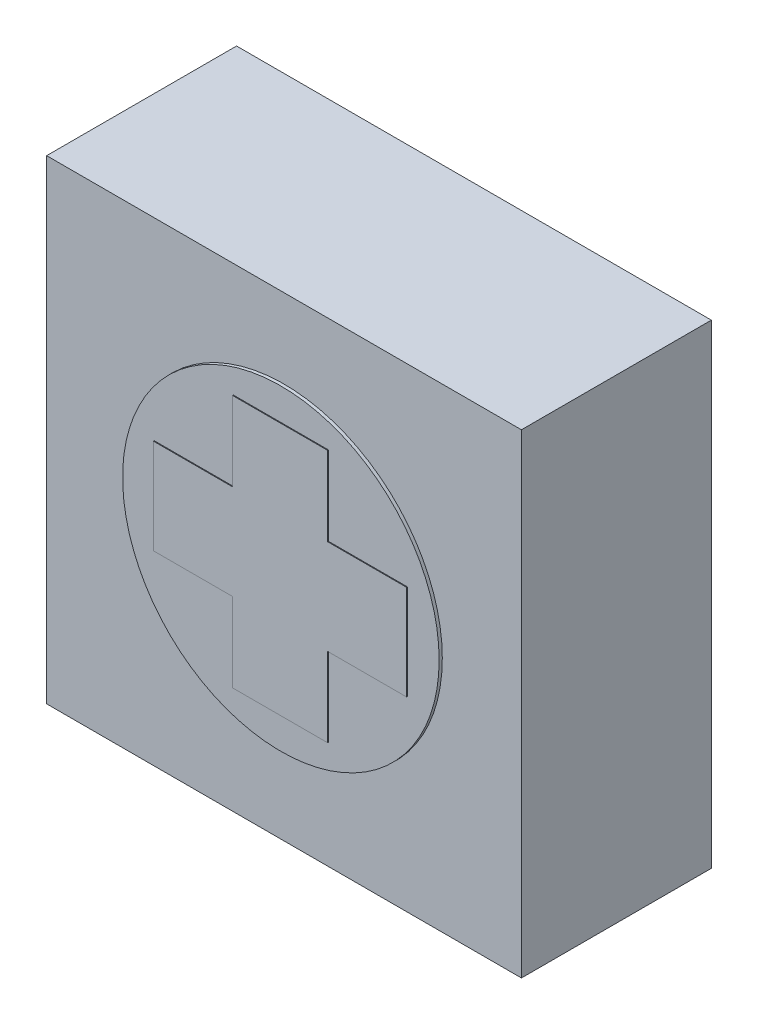
ISO-10303-21;
HEADER;
FILE_DESCRIPTION(('STEP AP214'),'2;1');
FILE_NAME('part.step','',(''),(''),'','','');
FILE_SCHEMA(('AUTOMOTIVE_DESIGN { 1 0 10303 214 1 1 1 1 }'));
ENDSEC;
DATA;
#1=APPLICATION_CONTEXT('core data for automotive mechanical design processes');
#2=APPLICATION_PROTOCOL_DEFINITION('international standard','automotive_design',2000,#1);
#3=PRODUCT_CONTEXT('',#1,'mechanical');
#4=PRODUCT('Part','Part','',(#3));
#5=PRODUCT_RELATED_PRODUCT_CATEGORY('part','',(#4));
#6=PRODUCT_DEFINITION_FORMATION('','',#4);
#7=PRODUCT_DEFINITION_CONTEXT('part definition',#1,'design');
#8=PRODUCT_DEFINITION('design','',#6,#7);
#9=PRODUCT_DEFINITION_SHAPE('','',#8);
#10=(LENGTH_UNIT() NAMED_UNIT(*) SI_UNIT(.MILLI.,.METRE.));
#11=(NAMED_UNIT(*) PLANE_ANGLE_UNIT() SI_UNIT($,.RADIAN.));
#12=(NAMED_UNIT(*) SI_UNIT($,.STERADIAN.) SOLID_ANGLE_UNIT());
#13=UNCERTAINTY_MEASURE_WITH_UNIT(LENGTH_MEASURE(1.E-05),#10,'distance_accuracy_value','');
#14=(GEOMETRIC_REPRESENTATION_CONTEXT(3) GLOBAL_UNCERTAINTY_ASSIGNED_CONTEXT((#13)) GLOBAL_UNIT_ASSIGNED_CONTEXT((#10,
#11,#12)) REPRESENTATION_CONTEXT('',''));
#15=CARTESIAN_POINT('',(0.,0.,0.));
#16=DIRECTION('',(0.,0.,1.));
#17=DIRECTION('',(1.,0.,0.));
#18=AXIS2_PLACEMENT_3D('',#15,#16,#17);
#19=CARTESIAN_POINT('',(37.5,37.5,15.0993109944239));
#20=DIRECTION('',(-1.,0.,0.));
#21=DIRECTION('',(0.,0.,1.));
#22=AXIS2_PLACEMENT_3D('',#19,#20,#21);
#23=PLANE('',#22);
#24=DIRECTION('',(0.,1.,0.));
#25=VECTOR('',#24,1.);
#26=CARTESIAN_POINT('',(37.5,37.5,-14.9006890055761));
#27=LINE('',#26,#25);
#28=CARTESIAN_POINT('',(37.5,-37.5,-14.9006890055761));
#29=VERTEX_POINT('',#28);
#30=CARTESIAN_POINT('',(37.5,37.5,-14.9006890055761));
#31=VERTEX_POINT('',#30);
#32=EDGE_CURVE('E243',#29,#31,#27,.T.);
#33=ORIENTED_EDGE('',*,*,#32,.T.);
#34=DIRECTION('',(0.,0.,-1.));
#35=VECTOR('',#34,1.);
#36=CARTESIAN_POINT('',(37.5,37.5,15.0993109944239));
#37=LINE('',#36,#35);
#38=CARTESIAN_POINT('',(37.5,37.5,15.0993109944239));
#39=VERTEX_POINT('',#38);
#40=EDGE_CURVE('E248',#39,#31,#37,.T.);
#41=ORIENTED_EDGE('',*,*,#40,.F.);
#42=DIRECTION('',(0.,1.,0.));
#43=VECTOR('',#42,1.);
#44=CARTESIAN_POINT('',(37.5,37.5,15.0993109944239));
#45=LINE('',#44,#43);
#46=CARTESIAN_POINT('',(37.5,-37.5,15.0993109944239));
#47=VERTEX_POINT('',#46);
#48=EDGE_CURVE('E249',#47,#39,#45,.T.);
#49=ORIENTED_EDGE('',*,*,#48,.F.);
#50=DIRECTION('',(0.,0.,-1.));
#51=VECTOR('',#50,1.);
#52=CARTESIAN_POINT('',(37.5,-37.5,15.0993109944239));
#53=LINE('',#52,#51);
#54=EDGE_CURVE('E255',#47,#29,#53,.T.);
#55=ORIENTED_EDGE('',*,*,#54,.T.);
#56=EDGE_LOOP('',(#33,#41,#49,#55));
#57=FACE_BOUND('',#56,.T.);
#58=ADVANCED_FACE('F44',(#57),#23,.F.);
#59=CARTESIAN_POINT('',(-37.5,37.5,15.0993109944239));
#60=DIRECTION('',(0.,-1.,0.));
#61=DIRECTION('',(0.,0.,-1.));
#62=AXIS2_PLACEMENT_3D('',#59,#60,#61);
#63=PLANE('',#62);
#64=DIRECTION('',(-1.,0.,0.));
#65=VECTOR('',#64,1.);
#66=CARTESIAN_POINT('',(-37.5,37.5,-14.9006890055761));
#67=LINE('',#66,#65);
#68=CARTESIAN_POINT('',(-37.5,37.5,-14.9006890055761));
#69=VERTEX_POINT('',#68);
#70=EDGE_CURVE('E258',#31,#69,#67,.T.);
#71=ORIENTED_EDGE('',*,*,#70,.T.);
#72=DIRECTION('',(0.,0.,-1.));
#73=VECTOR('',#72,1.);
#74=CARTESIAN_POINT('',(-37.5,37.5,15.0993109944239));
#75=LINE('',#74,#73);
#76=CARTESIAN_POINT('',(-37.5,37.5,15.0993109944239));
#77=VERTEX_POINT('',#76);
#78=EDGE_CURVE('E266',#77,#69,#75,.T.);
#79=ORIENTED_EDGE('',*,*,#78,.F.);
#80=DIRECTION('',(-1.,0.,0.));
#81=VECTOR('',#80,1.);
#82=CARTESIAN_POINT('',(-37.5,37.5,15.0993109944239));
#83=LINE('',#82,#81);
#84=EDGE_CURVE('E96',#39,#77,#83,.T.);
#85=ORIENTED_EDGE('',*,*,#84,.F.);
#86=ORIENTED_EDGE('',*,*,#40,.T.);
#87=EDGE_LOOP('',(#71,#79,#85,#86));
#88=FACE_BOUND('',#87,.T.);
#89=ADVANCED_FACE('F340',(#88),#63,.F.);
#90=CARTESIAN_POINT('',(-37.5,37.5,15.0993109944239));
#91=DIRECTION('',(1.,0.,0.));
#92=DIRECTION('',(0.,0.,-1.));
#93=AXIS2_PLACEMENT_3D('',#90,#91,#92);
#94=PLANE('',#93);
#95=DIRECTION('',(0.,-1.,0.));
#96=VECTOR('',#95,1.);
#97=CARTESIAN_POINT('',(-37.5,37.5,-14.9006890055761));
#98=LINE('',#97,#96);
#99=CARTESIAN_POINT('',(-37.5,-37.5,-14.9006890055761));
#100=VERTEX_POINT('',#99);
#101=EDGE_CURVE('E260',#69,#100,#98,.T.);
#102=ORIENTED_EDGE('',*,*,#101,.T.);
#103=DIRECTION('',(0.,0.,-1.));
#104=VECTOR('',#103,1.);
#105=CARTESIAN_POINT('',(-37.5,-37.5,15.0993109944239));
#106=LINE('',#105,#104);
#107=CARTESIAN_POINT('',(-37.5,-37.5,15.0993109944239));
#108=VERTEX_POINT('',#107);
#109=EDGE_CURVE('E264',#108,#100,#106,.T.);
#110=ORIENTED_EDGE('',*,*,#109,.F.);
#111=DIRECTION('',(0.,-1.,0.));
#112=VECTOR('',#111,1.);
#113=CARTESIAN_POINT('',(-37.5,37.5,15.0993109944239));
#114=LINE('',#113,#112);
#115=EDGE_CURVE('E252',#77,#108,#114,.T.);
#116=ORIENTED_EDGE('',*,*,#115,.F.);
#117=ORIENTED_EDGE('',*,*,#78,.T.);
#118=EDGE_LOOP('',(#102,#110,#116,#117));
#119=FACE_BOUND('',#118,.T.);
#120=ADVANCED_FACE('F345',(#119),#94,.F.);
#121=CARTESIAN_POINT('',(-37.5,-37.5,15.0993109944239));
#122=DIRECTION('',(0.,1.,0.));
#123=DIRECTION('',(0.,0.,1.));
#124=AXIS2_PLACEMENT_3D('',#121,#122,#123);
#125=PLANE('',#124);
#126=DIRECTION('',(1.,0.,0.));
#127=VECTOR('',#126,1.);
#128=CARTESIAN_POINT('',(-37.5,-37.5,-14.9006890055761));
#129=LINE('',#128,#127);
#130=EDGE_CURVE('E88',#100,#29,#129,.T.);
#131=ORIENTED_EDGE('',*,*,#130,.T.);
#132=ORIENTED_EDGE('',*,*,#54,.F.);
#133=DIRECTION('',(1.,0.,0.));
#134=VECTOR('',#133,1.);
#135=CARTESIAN_POINT('',(-37.5,-37.5,15.0993109944239));
#136=LINE('',#135,#134);
#137=EDGE_CURVE('E67',#108,#47,#136,.T.);
#138=ORIENTED_EDGE('',*,*,#137,.F.);
#139=ORIENTED_EDGE('',*,*,#109,.T.);
#140=EDGE_LOOP('',(#131,#132,#138,#139));
#141=FACE_BOUND('',#140,.T.);
#142=ADVANCED_FACE('F357',(#141),#125,.F.);
#143=CARTESIAN_POINT('',(0.,0.,15.0993109944239));
#144=DIRECTION('',(0.,0.,1.));
#145=DIRECTION('',(1.,0.,0.));
#146=AXIS2_PLACEMENT_3D('',#143,#144,#145);
#147=PLANE('',#146);
#148=CARTESIAN_POINT('',(0.,0.,15.0993109944239));
#149=DIRECTION('',(0.,0.,1.));
#150=DIRECTION('',(1.,0.,0.));
#151=AXIS2_PLACEMENT_3D('',#148,#149,#150);
#152=CIRCLE('',#151,25.);
#153=CARTESIAN_POINT('',(25.,0.,15.0993109944239));
#154=VERTEX_POINT('',#153);
#155=EDGE_CURVE('E244',#154,#154,#152,.T.);
#156=ORIENTED_EDGE('',*,*,#155,.F.);
#157=EDGE_LOOP('',(#156));
#158=FACE_BOUND('',#157,.T.);
#159=ORIENTED_EDGE('',*,*,#48,.T.);
#160=ORIENTED_EDGE('',*,*,#84,.T.);
#161=ORIENTED_EDGE('',*,*,#115,.T.);
#162=ORIENTED_EDGE('',*,*,#137,.T.);
#163=EDGE_LOOP('',(#159,#160,#161,#162));
#164=FACE_BOUND('',#163,.T.);
#165=ADVANCED_FACE('F355',(#158,#164),#147,.T.);
#166=CARTESIAN_POINT('',(0.,0.,-14.9006890055761));
#167=DIRECTION('',(0.,0.,1.));
#168=DIRECTION('',(1.,0.,0.));
#169=AXIS2_PLACEMENT_3D('',#166,#167,#168);
#170=PLANE('',#169);
#171=ORIENTED_EDGE('',*,*,#32,.F.);
#172=ORIENTED_EDGE('',*,*,#130,.F.);
#173=ORIENTED_EDGE('',*,*,#101,.F.);
#174=ORIENTED_EDGE('',*,*,#70,.F.);
#175=EDGE_LOOP('',(#171,#172,#173,#174));
#176=FACE_BOUND('',#175,.T.);
#177=ADVANCED_FACE('F350',(#176),#170,.F.);
#178=CARTESIAN_POINT('',(0.,0.,15.5993109944239));
#179=DIRECTION('',(0.,0.,-1.));
#180=DIRECTION('',(-1.,0.,0.));
#181=AXIS2_PLACEMENT_3D('',#178,#179,#180);
#182=CYLINDRICAL_SURFACE('',#181,25.);
#183=CARTESIAN_POINT('',(0.,0.,15.5993109944239));
#184=DIRECTION('',(0.,0.,1.));
#185=DIRECTION('',(1.,0.,0.));
#186=AXIS2_PLACEMENT_3D('',#183,#184,#185);
#187=CIRCLE('',#186,25.);
#188=CARTESIAN_POINT('',(25.,0.,15.5993109944239));
#189=VERTEX_POINT('',#188);
#190=EDGE_CURVE('E174',#189,#189,#187,.T.);
#191=ORIENTED_EDGE('',*,*,#190,.F.);
#192=EDGE_LOOP('',(#191));
#193=FACE_BOUND('',#192,.T.);
#194=ORIENTED_EDGE('',*,*,#155,.T.);
#195=EDGE_LOOP('',(#194));
#196=FACE_BOUND('',#195,.T.);
#197=ADVANCED_FACE('F364',(#193,#196),#182,.T.);
#198=CARTESIAN_POINT('',(0.,0.,15.5993109944239));
#199=DIRECTION('',(0.,0.,1.));
#200=DIRECTION('',(1.,0.,0.));
#201=AXIS2_PLACEMENT_3D('',#198,#199,#200);
#202=PLANE('',#201);
#203=DIRECTION('',(-1.,0.,0.));
#204=VECTOR('',#203,1.);
#205=CARTESIAN_POINT('',(0.,7.5,15.5993109944239));
#206=LINE('',#205,#204);
#207=CARTESIAN_POINT('',(-7.50000000000001,7.5,15.5993109944239));
#208=VERTEX_POINT('',#207);
#209=CARTESIAN_POINT('',(-20.,7.5,15.5993109944239));
#210=VERTEX_POINT('',#209);
#211=EDGE_CURVE('E11',#208,#210,#206,.T.);
#212=ORIENTED_EDGE('',*,*,#211,.F.);
#213=DIRECTION('',(0.,1.,0.));
#214=VECTOR('',#213,1.);
#215=CARTESIAN_POINT('',(-7.50000000000001,0.,15.5993109944239));
#216=LINE('',#215,#214);
#217=CARTESIAN_POINT('',(-7.50000000000001,20.,15.5993109944239));
#218=VERTEX_POINT('',#217);
#219=EDGE_CURVE('E247',#208,#218,#216,.T.);
#220=ORIENTED_EDGE('',*,*,#219,.T.);
#221=DIRECTION('',(-1.,0.,0.));
#222=VECTOR('',#221,1.);
#223=CARTESIAN_POINT('',(0.,20.,15.5993109944239));
#224=LINE('',#223,#222);
#225=CARTESIAN_POINT('',(7.49999999999999,20.,15.5993109944239));
#226=VERTEX_POINT('',#225);
#227=EDGE_CURVE('E272',#226,#218,#224,.T.);
#228=ORIENTED_EDGE('',*,*,#227,.F.);
#229=DIRECTION('',(0.,1.,0.));
#230=VECTOR('',#229,1.);
#231=CARTESIAN_POINT('',(7.49999999999999,0.,15.5993109944239));
#232=LINE('',#231,#230);
#233=CARTESIAN_POINT('',(7.49999999999999,7.5,15.5993109944239));
#234=VERTEX_POINT('',#233);
#235=EDGE_CURVE('E274',#234,#226,#232,.T.);
#236=ORIENTED_EDGE('',*,*,#235,.F.);
#237=DIRECTION('',(-1.,0.,0.));
#238=VECTOR('',#237,1.);
#239=CARTESIAN_POINT('',(0.,7.5,15.5993109944239));
#240=LINE('',#239,#238);
#241=CARTESIAN_POINT('',(20.,7.5,15.5993109944239));
#242=VERTEX_POINT('',#241);
#243=EDGE_CURVE('E276',#242,#234,#240,.T.);
#244=ORIENTED_EDGE('',*,*,#243,.F.);
#245=DIRECTION('',(0.,-1.,0.));
#246=VECTOR('',#245,1.);
#247=CARTESIAN_POINT('',(20.,0.,15.5993109944239));
#248=LINE('',#247,#246);
#249=CARTESIAN_POINT('',(20.,-7.5,15.5993109944239));
#250=VERTEX_POINT('',#249);
#251=EDGE_CURVE('E278',#242,#250,#248,.T.);
#252=ORIENTED_EDGE('',*,*,#251,.T.);
#253=DIRECTION('',(-1.,0.,0.));
#254=VECTOR('',#253,1.);
#255=CARTESIAN_POINT('',(0.,-7.5,15.5993109944239));
#256=LINE('',#255,#254);
#257=CARTESIAN_POINT('',(7.49999999999999,-7.5,15.5993109944239));
#258=VERTEX_POINT('',#257);
#259=EDGE_CURVE('E281',#250,#258,#256,.T.);
#260=ORIENTED_EDGE('',*,*,#259,.T.);
#261=DIRECTION('',(0.,1.,0.));
#262=VECTOR('',#261,1.);
#263=CARTESIAN_POINT('',(7.49999999999999,0.,15.5993109944239));
#264=LINE('',#263,#262);
#265=CARTESIAN_POINT('',(7.5,-20.,15.5993109944239));
#266=VERTEX_POINT('',#265);
#267=EDGE_CURVE('E284',#266,#258,#264,.T.);
#268=ORIENTED_EDGE('',*,*,#267,.F.);
#269=DIRECTION('',(-1.,0.,0.));
#270=VECTOR('',#269,1.);
#271=CARTESIAN_POINT('',(0.,-20.,15.5993109944239));
#272=LINE('',#271,#270);
#273=CARTESIAN_POINT('',(-7.5,-20.,15.5993109944239));
#274=VERTEX_POINT('',#273);
#275=EDGE_CURVE('E286',#266,#274,#272,.T.);
#276=ORIENTED_EDGE('',*,*,#275,.T.);
#277=DIRECTION('',(0.,1.,0.));
#278=VECTOR('',#277,1.);
#279=CARTESIAN_POINT('',(-7.50000000000001,0.,15.5993109944239));
#280=LINE('',#279,#278);
#281=CARTESIAN_POINT('',(-7.50000000000001,-7.5,15.5993109944239));
#282=VERTEX_POINT('',#281);
#283=EDGE_CURVE('E289',#274,#282,#280,.T.);
#284=ORIENTED_EDGE('',*,*,#283,.T.);
#285=DIRECTION('',(-1.,0.,0.));
#286=VECTOR('',#285,1.);
#287=CARTESIAN_POINT('',(0.,-7.5,15.5993109944239));
#288=LINE('',#287,#286);
#289=CARTESIAN_POINT('',(-20.,-7.5,15.5993109944239));
#290=VERTEX_POINT('',#289);
#291=EDGE_CURVE('E292',#282,#290,#288,.T.);
#292=ORIENTED_EDGE('',*,*,#291,.T.);
#293=DIRECTION('',(0.,-1.,0.));
#294=VECTOR('',#293,1.);
#295=CARTESIAN_POINT('',(-20.,0.,15.5993109944239));
#296=LINE('',#295,#294);
#297=EDGE_CURVE('E51',#210,#290,#296,.T.);
#298=ORIENTED_EDGE('',*,*,#297,.F.);
#299=EDGE_LOOP('',(#212,#220,#228,#236,#244,#252,#260,#268,#276,#284,#292,#298));
#300=FACE_BOUND('',#299,.T.);
#301=ORIENTED_EDGE('',*,*,#190,.T.);
#302=EDGE_LOOP('',(#301));
#303=FACE_BOUND('',#302,.T.);
#304=ADVANCED_FACE('F298',(#300,#303),#202,.T.);
#305=CARTESIAN_POINT('',(0.,7.5,15.7243109944239));
#306=DIRECTION('',(0.,1.,0.));
#307=DIRECTION('',(0.,0.,1.));
#308=AXIS2_PLACEMENT_3D('',#305,#306,#307);
#309=PLANE('',#308);
#310=DIRECTION('',(0.,0.,-1.));
#311=VECTOR('',#310,1.);
#312=CARTESIAN_POINT('',(-7.50000000000001,7.5,15.7243109944239));
#313=LINE('',#312,#311);
#314=CARTESIAN_POINT('',(-7.50000000000001,7.5,15.7243109944239));
#315=VERTEX_POINT('',#314);
#316=EDGE_CURVE('E213',#315,#208,#313,.T.);
#317=ORIENTED_EDGE('',*,*,#316,.T.);
#318=ORIENTED_EDGE('',*,*,#211,.T.);
#319=DIRECTION('',(0.,0.,-1.));
#320=VECTOR('',#319,1.);
#321=CARTESIAN_POINT('',(-20.,7.5,15.7243109944239));
#322=LINE('',#321,#320);
#323=CARTESIAN_POINT('',(-20.,7.5,15.7243109944239));
#324=VERTEX_POINT('',#323);
#325=EDGE_CURVE('E165',#324,#210,#322,.T.);
#326=ORIENTED_EDGE('',*,*,#325,.F.);
#327=DIRECTION('',(1.,0.,0.));
#328=VECTOR('',#327,1.);
#329=CARTESIAN_POINT('',(0.,7.5,15.7243109944239));
#330=LINE('',#329,#328);
#331=EDGE_CURVE('E169',#324,#315,#330,.T.);
#332=ORIENTED_EDGE('',*,*,#331,.T.);
#333=EDGE_LOOP('',(#317,#318,#326,#332));
#334=FACE_BOUND('',#333,.T.);
#335=ADVANCED_FACE('F168',(#334),#309,.T.);
#336=CARTESIAN_POINT('',(-20.,0.,15.7243109944239));
#337=DIRECTION('',(-1.,0.,0.));
#338=DIRECTION('',(0.,0.,1.));
#339=AXIS2_PLACEMENT_3D('',#336,#337,#338);
#340=PLANE('',#339);
#341=ORIENTED_EDGE('',*,*,#325,.T.);
#342=ORIENTED_EDGE('',*,*,#297,.T.);
#343=DIRECTION('',(0.,0.,-1.));
#344=VECTOR('',#343,1.);
#345=CARTESIAN_POINT('',(-20.,-7.5,15.7243109944239));
#346=LINE('',#345,#344);
#347=CARTESIAN_POINT('',(-20.,-7.5,15.7243109944239));
#348=VERTEX_POINT('',#347);
#349=EDGE_CURVE('E175',#348,#290,#346,.T.);
#350=ORIENTED_EDGE('',*,*,#349,.F.);
#351=DIRECTION('',(0.,1.,0.));
#352=VECTOR('',#351,1.);
#353=CARTESIAN_POINT('',(-20.,0.,15.7243109944239));
#354=LINE('',#353,#352);
#355=EDGE_CURVE('E180',#348,#324,#354,.T.);
#356=ORIENTED_EDGE('',*,*,#355,.T.);
#357=EDGE_LOOP('',(#341,#342,#350,#356));
#358=FACE_BOUND('',#357,.T.);
#359=ADVANCED_FACE('F185',(#358),#340,.T.);
#360=CARTESIAN_POINT('',(0.,-7.5,15.7243109944239));
#361=DIRECTION('',(0.,1.,0.));
#362=DIRECTION('',(0.,0.,1.));
#363=AXIS2_PLACEMENT_3D('',#360,#361,#362);
#364=PLANE('',#363);
#365=ORIENTED_EDGE('',*,*,#291,.F.);
#366=DIRECTION('',(0.,0.,-1.));
#367=VECTOR('',#366,1.);
#368=CARTESIAN_POINT('',(-7.50000000000001,-7.5,15.7243109944239));
#369=LINE('',#368,#367);
#370=CARTESIAN_POINT('',(-7.50000000000001,-7.5,15.7243109944239));
#371=VERTEX_POINT('',#370);
#372=EDGE_CURVE('E237',#371,#282,#369,.T.);
#373=ORIENTED_EDGE('',*,*,#372,.F.);
#374=DIRECTION('',(1.,0.,0.));
#375=VECTOR('',#374,1.);
#376=CARTESIAN_POINT('',(0.,-7.5,15.7243109944239));
#377=LINE('',#376,#375);
#378=EDGE_CURVE('E188',#348,#371,#377,.T.);
#379=ORIENTED_EDGE('',*,*,#378,.F.);
#380=ORIENTED_EDGE('',*,*,#349,.T.);
#381=EDGE_LOOP('',(#365,#373,#379,#380));
#382=FACE_BOUND('',#381,.T.);
#383=ADVANCED_FACE('F296',(#382),#364,.F.);
#384=CARTESIAN_POINT('',(-7.50000000000001,0.,15.7243109944239));
#385=DIRECTION('',(1.,0.,0.));
#386=DIRECTION('',(0.,1.,0.));
#387=AXIS2_PLACEMENT_3D('',#384,#385,#386);
#388=PLANE('',#387);
#389=ORIENTED_EDGE('',*,*,#283,.F.);
#390=DIRECTION('',(0.,0.,-1.));
#391=VECTOR('',#390,1.);
#392=CARTESIAN_POINT('',(-7.5,-20.,15.7243109944239));
#393=LINE('',#392,#391);
#394=CARTESIAN_POINT('',(-7.5,-20.,15.7243109944239));
#395=VERTEX_POINT('',#394);
#396=EDGE_CURVE('E234',#395,#274,#393,.T.);
#397=ORIENTED_EDGE('',*,*,#396,.F.);
#398=DIRECTION('',(0.,-1.,0.));
#399=VECTOR('',#398,1.);
#400=CARTESIAN_POINT('',(-7.50000000000001,0.,15.7243109944239));
#401=LINE('',#400,#399);
#402=EDGE_CURVE('E190',#371,#395,#401,.T.);
#403=ORIENTED_EDGE('',*,*,#402,.F.);
#404=ORIENTED_EDGE('',*,*,#372,.T.);
#405=EDGE_LOOP('',(#389,#397,#403,#404));
#406=FACE_BOUND('',#405,.T.);
#407=ADVANCED_FACE('F303',(#406),#388,.F.);
#408=CARTESIAN_POINT('',(0.,-20.,15.7243109944239));
#409=DIRECTION('',(0.,1.,0.));
#410=DIRECTION('',(0.,0.,1.));
#411=AXIS2_PLACEMENT_3D('',#408,#409,#410);
#412=PLANE('',#411);
#413=ORIENTED_EDGE('',*,*,#275,.F.);
#414=DIRECTION('',(0.,0.,-1.));
#415=VECTOR('',#414,1.);
#416=CARTESIAN_POINT('',(7.5,-20.,15.7243109944239));
#417=LINE('',#416,#415);
#418=CARTESIAN_POINT('',(7.5,-20.,15.7243109944239));
#419=VERTEX_POINT('',#418);
#420=EDGE_CURVE('E231',#419,#266,#417,.T.);
#421=ORIENTED_EDGE('',*,*,#420,.F.);
#422=DIRECTION('',(1.,0.,0.));
#423=VECTOR('',#422,1.);
#424=CARTESIAN_POINT('',(0.,-20.,15.7243109944239));
#425=LINE('',#424,#423);
#426=EDGE_CURVE('E194',#395,#419,#425,.T.);
#427=ORIENTED_EDGE('',*,*,#426,.F.);
#428=ORIENTED_EDGE('',*,*,#396,.T.);
#429=EDGE_LOOP('',(#413,#421,#427,#428));
#430=FACE_BOUND('',#429,.T.);
#431=ADVANCED_FACE('F307',(#430),#412,.F.);
#432=CARTESIAN_POINT('',(7.49999999999999,0.,15.7243109944239));
#433=DIRECTION('',(1.,0.,0.));
#434=DIRECTION('',(0.,1.,0.));
#435=AXIS2_PLACEMENT_3D('',#432,#433,#434);
#436=PLANE('',#435);
#437=ORIENTED_EDGE('',*,*,#420,.T.);
#438=ORIENTED_EDGE('',*,*,#267,.T.);
#439=DIRECTION('',(0.,0.,-1.));
#440=VECTOR('',#439,1.);
#441=CARTESIAN_POINT('',(7.49999999999999,-7.5,15.7243109944239));
#442=LINE('',#441,#440);
#443=CARTESIAN_POINT('',(7.49999999999999,-7.5,15.7243109944239));
#444=VERTEX_POINT('',#443);
#445=EDGE_CURVE('E228',#444,#258,#442,.T.);
#446=ORIENTED_EDGE('',*,*,#445,.F.);
#447=DIRECTION('',(0.,-1.,0.));
#448=VECTOR('',#447,1.);
#449=CARTESIAN_POINT('',(7.49999999999999,0.,15.7243109944239));
#450=LINE('',#449,#448);
#451=EDGE_CURVE('E196',#444,#419,#450,.T.);
#452=ORIENTED_EDGE('',*,*,#451,.T.);
#453=EDGE_LOOP('',(#437,#438,#446,#452));
#454=FACE_BOUND('',#453,.T.);
#455=ADVANCED_FACE('F313',(#454),#436,.T.);
#456=CARTESIAN_POINT('',(0.,-7.5,15.7243109944239));
#457=DIRECTION('',(0.,1.,0.));
#458=DIRECTION('',(0.,0.,1.));
#459=AXIS2_PLACEMENT_3D('',#456,#457,#458);
#460=PLANE('',#459);
#461=ORIENTED_EDGE('',*,*,#259,.F.);
#462=DIRECTION('',(0.,0.,-1.));
#463=VECTOR('',#462,1.);
#464=CARTESIAN_POINT('',(20.,-7.5,15.7243109944239));
#465=LINE('',#464,#463);
#466=CARTESIAN_POINT('',(20.,-7.5,15.7243109944239));
#467=VERTEX_POINT('',#466);
#468=EDGE_CURVE('E225',#467,#250,#465,.T.);
#469=ORIENTED_EDGE('',*,*,#468,.F.);
#470=DIRECTION('',(1.,0.,0.));
#471=VECTOR('',#470,1.);
#472=CARTESIAN_POINT('',(0.,-7.5,15.7243109944239));
#473=LINE('',#472,#471);
#474=EDGE_CURVE('E199',#444,#467,#473,.T.);
#475=ORIENTED_EDGE('',*,*,#474,.F.);
#476=ORIENTED_EDGE('',*,*,#445,.T.);
#477=EDGE_LOOP('',(#461,#469,#475,#476));
#478=FACE_BOUND('',#477,.T.);
#479=ADVANCED_FACE('F315',(#478),#460,.F.);
#480=CARTESIAN_POINT('',(20.,0.,15.7243109944239));
#481=DIRECTION('',(-1.,0.,0.));
#482=DIRECTION('',(0.,0.,1.));
#483=AXIS2_PLACEMENT_3D('',#480,#481,#482);
#484=PLANE('',#483);
#485=ORIENTED_EDGE('',*,*,#251,.F.);
#486=DIRECTION('',(0.,0.,-1.));
#487=VECTOR('',#486,1.);
#488=CARTESIAN_POINT('',(20.,7.5,15.7243109944239));
#489=LINE('',#488,#487);
#490=CARTESIAN_POINT('',(20.,7.5,15.7243109944239));
#491=VERTEX_POINT('',#490);
#492=EDGE_CURVE('E222',#491,#242,#489,.T.);
#493=ORIENTED_EDGE('',*,*,#492,.F.);
#494=DIRECTION('',(0.,1.,0.));
#495=VECTOR('',#494,1.);
#496=CARTESIAN_POINT('',(20.,0.,15.7243109944239));
#497=LINE('',#496,#495);
#498=EDGE_CURVE('E201',#467,#491,#497,.T.);
#499=ORIENTED_EDGE('',*,*,#498,.F.);
#500=ORIENTED_EDGE('',*,*,#468,.T.);
#501=EDGE_LOOP('',(#485,#493,#499,#500));
#502=FACE_BOUND('',#501,.T.);
#503=ADVANCED_FACE('F319',(#502),#484,.F.);
#504=CARTESIAN_POINT('',(0.,7.5,15.7243109944239));
#505=DIRECTION('',(0.,1.,0.));
#506=DIRECTION('',(0.,0.,1.));
#507=AXIS2_PLACEMENT_3D('',#504,#505,#506);
#508=PLANE('',#507);
#509=ORIENTED_EDGE('',*,*,#492,.T.);
#510=ORIENTED_EDGE('',*,*,#243,.T.);
#511=DIRECTION('',(0.,0.,-1.));
#512=VECTOR('',#511,1.);
#513=CARTESIAN_POINT('',(7.49999999999999,7.5,15.7243109944239));
#514=LINE('',#513,#512);
#515=CARTESIAN_POINT('',(7.49999999999999,7.5,15.7243109944239));
#516=VERTEX_POINT('',#515);
#517=EDGE_CURVE('E219',#516,#234,#514,.T.);
#518=ORIENTED_EDGE('',*,*,#517,.F.);
#519=DIRECTION('',(1.,0.,0.));
#520=VECTOR('',#519,1.);
#521=CARTESIAN_POINT('',(0.,7.5,15.7243109944239));
#522=LINE('',#521,#520);
#523=EDGE_CURVE('E203',#516,#491,#522,.T.);
#524=ORIENTED_EDGE('',*,*,#523,.T.);
#525=EDGE_LOOP('',(#509,#510,#518,#524));
#526=FACE_BOUND('',#525,.T.);
#527=ADVANCED_FACE('F470',(#526),#508,.T.);
#528=CARTESIAN_POINT('',(7.49999999999999,0.,15.7243109944239));
#529=DIRECTION('',(1.,0.,0.));
#530=DIRECTION('',(0.,1.,0.));
#531=AXIS2_PLACEMENT_3D('',#528,#529,#530);
#532=PLANE('',#531);
#533=ORIENTED_EDGE('',*,*,#517,.T.);
#534=ORIENTED_EDGE('',*,*,#235,.T.);
#535=DIRECTION('',(0.,0.,-1.));
#536=VECTOR('',#535,1.);
#537=CARTESIAN_POINT('',(7.49999999999999,20.,15.7243109944239));
#538=LINE('',#537,#536);
#539=CARTESIAN_POINT('',(7.49999999999999,20.,15.7243109944239));
#540=VERTEX_POINT('',#539);
#541=EDGE_CURVE('E216',#540,#226,#538,.T.);
#542=ORIENTED_EDGE('',*,*,#541,.F.);
#543=DIRECTION('',(0.,-1.,0.));
#544=VECTOR('',#543,1.);
#545=CARTESIAN_POINT('',(7.49999999999999,0.,15.7243109944239));
#546=LINE('',#545,#544);
#547=EDGE_CURVE('E206',#540,#516,#546,.T.);
#548=ORIENTED_EDGE('',*,*,#547,.T.);
#549=EDGE_LOOP('',(#533,#534,#542,#548));
#550=FACE_BOUND('',#549,.T.);
#551=ADVANCED_FACE('F324',(#550),#532,.T.);
#552=CARTESIAN_POINT('',(0.,20.,15.7243109944239));
#553=DIRECTION('',(0.,1.,0.));
#554=DIRECTION('',(0.,0.,1.));
#555=AXIS2_PLACEMENT_3D('',#552,#553,#554);
#556=PLANE('',#555);
#557=ORIENTED_EDGE('',*,*,#541,.T.);
#558=ORIENTED_EDGE('',*,*,#227,.T.);
#559=DIRECTION('',(0.,0.,-1.));
#560=VECTOR('',#559,1.);
#561=CARTESIAN_POINT('',(-7.50000000000001,20.,15.7243109944239));
#562=LINE('',#561,#560);
#563=CARTESIAN_POINT('',(-7.50000000000001,20.,15.7243109944239));
#564=VERTEX_POINT('',#563);
#565=EDGE_CURVE('E58',#564,#218,#562,.T.);
#566=ORIENTED_EDGE('',*,*,#565,.F.);
#567=DIRECTION('',(1.,0.,0.));
#568=VECTOR('',#567,1.);
#569=CARTESIAN_POINT('',(0.,20.,15.7243109944239));
#570=LINE('',#569,#568);
#571=EDGE_CURVE('E209',#564,#540,#570,.T.);
#572=ORIENTED_EDGE('',*,*,#571,.T.);
#573=EDGE_LOOP('',(#557,#558,#566,#572));
#574=FACE_BOUND('',#573,.T.);
#575=ADVANCED_FACE('F328',(#574),#556,.T.);
#576=CARTESIAN_POINT('',(-7.50000000000001,0.,15.7243109944239));
#577=DIRECTION('',(1.,0.,0.));
#578=DIRECTION('',(0.,1.,0.));
#579=AXIS2_PLACEMENT_3D('',#576,#577,#578);
#580=PLANE('',#579);
#581=ORIENTED_EDGE('',*,*,#219,.F.);
#582=ORIENTED_EDGE('',*,*,#316,.F.);
#583=DIRECTION('',(0.,-1.,0.));
#584=VECTOR('',#583,1.);
#585=CARTESIAN_POINT('',(-7.50000000000001,0.,15.7243109944239));
#586=LINE('',#585,#584);
#587=EDGE_CURVE('E182',#564,#315,#586,.T.);
#588=ORIENTED_EDGE('',*,*,#587,.F.);
#589=ORIENTED_EDGE('',*,*,#565,.T.);
#590=EDGE_LOOP('',(#581,#582,#588,#589));
#591=FACE_BOUND('',#590,.T.);
#592=ADVANCED_FACE('F330',(#591),#580,.F.);
#593=CARTESIAN_POINT('',(0.,0.,15.7243109944239));
#594=DIRECTION('',(0.,0.,1.));
#595=DIRECTION('',(1.,0.,0.));
#596=AXIS2_PLACEMENT_3D('',#593,#594,#595);
#597=PLANE('',#596);
#598=ORIENTED_EDGE('',*,*,#331,.F.);
#599=ORIENTED_EDGE('',*,*,#355,.F.);
#600=ORIENTED_EDGE('',*,*,#378,.T.);
#601=ORIENTED_EDGE('',*,*,#402,.T.);
#602=ORIENTED_EDGE('',*,*,#426,.T.);
#603=ORIENTED_EDGE('',*,*,#451,.F.);
#604=ORIENTED_EDGE('',*,*,#474,.T.);
#605=ORIENTED_EDGE('',*,*,#498,.T.);
#606=ORIENTED_EDGE('',*,*,#523,.F.);
#607=ORIENTED_EDGE('',*,*,#547,.F.);
#608=ORIENTED_EDGE('',*,*,#571,.F.);
#609=ORIENTED_EDGE('',*,*,#587,.T.);
#610=EDGE_LOOP('',(#598,#599,#600,#601,#602,#603,#604,#605,#606,#607,#608,#609));
#611=FACE_BOUND('',#610,.T.);
#612=ADVANCED_FACE('F179',(#611),#597,.T.);
#613=CLOSED_SHELL('',(#58,#89,#120,#142,#165,#177,#197,#304,#335,#359,#383,#407,#431,#455,#479,
#503,#527,#551,#575,#592,#612));
#614=MANIFOLD_SOLID_BREP('B2',#613);
#615=ADVANCED_BREP_SHAPE_REPRESENTATION('',(#18,#614),#14);
#616=SHAPE_DEFINITION_REPRESENTATION(#9,#615);
ENDSEC;
END-ISO-10303-21;
